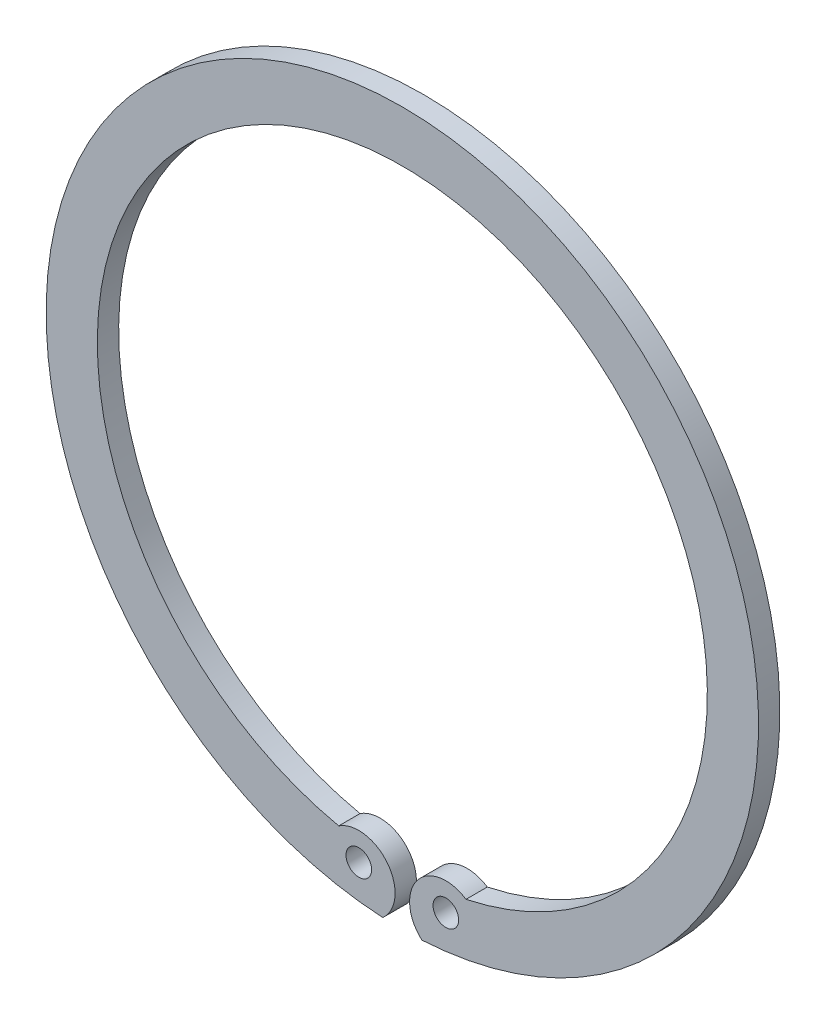
ISO-10303-21;
HEADER;
FILE_DESCRIPTION(('STEP AP214'),'2;1');
FILE_NAME('part.step','',(''),(''),'','','');
FILE_SCHEMA(('AUTOMOTIVE_DESIGN { 1 0 10303 214 1 1 1 1 }'));
ENDSEC;
DATA;
#1=APPLICATION_CONTEXT('core data for automotive mechanical design processes');
#2=APPLICATION_PROTOCOL_DEFINITION('international standard','automotive_design',2000,#1);
#3=PRODUCT_CONTEXT('',#1,'mechanical');
#4=PRODUCT('Part','Part','',(#3));
#5=PRODUCT_RELATED_PRODUCT_CATEGORY('part','',(#4));
#6=PRODUCT_DEFINITION_FORMATION('','',#4);
#7=PRODUCT_DEFINITION_CONTEXT('part definition',#1,'design');
#8=PRODUCT_DEFINITION('design','',#6,#7);
#9=PRODUCT_DEFINITION_SHAPE('','',#8);
#10=(LENGTH_UNIT() NAMED_UNIT(*) SI_UNIT(.MILLI.,.METRE.));
#11=(NAMED_UNIT(*) PLANE_ANGLE_UNIT() SI_UNIT($,.RADIAN.));
#12=(NAMED_UNIT(*) SI_UNIT($,.STERADIAN.) SOLID_ANGLE_UNIT());
#13=UNCERTAINTY_MEASURE_WITH_UNIT(LENGTH_MEASURE(1.E-05),#10,'distance_accuracy_value','');
#14=(GEOMETRIC_REPRESENTATION_CONTEXT(3) GLOBAL_UNCERTAINTY_ASSIGNED_CONTEXT((#13)) GLOBAL_UNIT_ASSIGNED_CONTEXT((#10,
#11,#12)) REPRESENTATION_CONTEXT('',''));
#15=CARTESIAN_POINT('',(0.,0.,0.));
#16=DIRECTION('',(0.,0.,1.));
#17=DIRECTION('',(1.,0.,0.));
#18=AXIS2_PLACEMENT_3D('',#15,#16,#17);
#19=CARTESIAN_POINT('',(5.1,-37.5,1.25));
#20=DIRECTION('',(0.,0.,-1.));
#21=DIRECTION('',(1.,0.,0.));
#22=AXIS2_PLACEMENT_3D('',#19,#20,#21);
#23=CYLINDRICAL_SURFACE('',#22,1.5);
#24=CARTESIAN_POINT('',(5.1,-37.5,0.));
#25=DIRECTION('',(0.,0.,1.));
#26=DIRECTION('',(1.,0.,0.));
#27=AXIS2_PLACEMENT_3D('',#24,#25,#26);
#28=CIRCLE('',#27,1.5);
#29=CARTESIAN_POINT('',(3.6,-37.5,0.));
#30=VERTEX_POINT('',#29);
#31=EDGE_CURVE('E33',#30,#30,#28,.T.);
#32=ORIENTED_EDGE('',*,*,#31,.F.);
#33=EDGE_LOOP('',(#32));
#34=FACE_BOUND('',#33,.T.);
#35=CARTESIAN_POINT('',(5.1,-37.5,2.5));
#36=DIRECTION('',(0.,0.,-1.));
#37=DIRECTION('',(1.,0.,0.));
#38=AXIS2_PLACEMENT_3D('',#35,#36,#37);
#39=CIRCLE('',#38,1.5);
#40=CARTESIAN_POINT('',(3.6,-37.5,2.5));
#41=VERTEX_POINT('',#40);
#42=EDGE_CURVE('E26',#41,#41,#39,.T.);
#43=ORIENTED_EDGE('',*,*,#42,.F.);
#44=EDGE_LOOP('',(#43));
#45=FACE_BOUND('',#44,.T.);
#46=ADVANCED_FACE('F16',(#34,#45),#23,.F.);
#47=CARTESIAN_POINT('',(-5.1,-37.5,1.25));
#48=DIRECTION('',(0.,0.,-1.));
#49=DIRECTION('',(1.,0.,0.));
#50=AXIS2_PLACEMENT_3D('',#47,#48,#49);
#51=CYLINDRICAL_SURFACE('',#50,1.5);
#52=CARTESIAN_POINT('',(-5.1,-37.5,0.));
#53=DIRECTION('',(0.,0.,1.));
#54=DIRECTION('',(1.,0.,0.));
#55=AXIS2_PLACEMENT_3D('',#52,#53,#54);
#56=CIRCLE('',#55,1.5);
#57=CARTESIAN_POINT('',(-6.6,-37.5,0.));
#58=VERTEX_POINT('',#57);
#59=EDGE_CURVE('E54',#58,#58,#56,.T.);
#60=ORIENTED_EDGE('',*,*,#59,.F.);
#61=EDGE_LOOP('',(#60));
#62=FACE_BOUND('',#61,.T.);
#63=CARTESIAN_POINT('',(-5.1,-37.5,2.5));
#64=DIRECTION('',(0.,0.,-1.));
#65=DIRECTION('',(1.,0.,0.));
#66=AXIS2_PLACEMENT_3D('',#63,#64,#65);
#67=CIRCLE('',#66,1.5);
#68=CARTESIAN_POINT('',(-6.6,-37.5,2.5));
#69=VERTEX_POINT('',#68);
#70=EDGE_CURVE('E79',#69,#69,#67,.T.);
#71=ORIENTED_EDGE('',*,*,#70,.F.);
#72=EDGE_LOOP('',(#71));
#73=FACE_BOUND('',#72,.T.);
#74=ADVANCED_FACE('F18',(#62,#73),#51,.F.);
#75=CARTESIAN_POINT('',(5.1,-38.5,1.25));
#76=DIRECTION('',(0.,0.,1.));
#77=DIRECTION('',(-1.,0.,0.));
#78=AXIS2_PLACEMENT_3D('',#75,#76,#77);
#79=CYLINDRICAL_SURFACE('',#78,4.25);
#80=DIRECTION('',(0.,0.,1.));
#81=VECTOR('',#80,1.);
#82=CARTESIAN_POINT('',(7.45718662486297,-34.9635934600831,1.25));
#83=LINE('',#82,#81);
#84=CARTESIAN_POINT('',(7.45718662486301,-34.9635934600831,0.));
#85=VERTEX_POINT('',#84);
#86=CARTESIAN_POINT('',(7.45718662486297,-34.9635934600831,2.5));
#87=VERTEX_POINT('',#86);
#88=EDGE_CURVE('E66',#85,#87,#83,.T.);
#89=ORIENTED_EDGE('',*,*,#88,.F.);
#90=CARTESIAN_POINT('',(5.1,-38.5,0.));
#91=DIRECTION('',(0.,0.,-1.));
#92=DIRECTION('',(-1.,0.,0.));
#93=AXIS2_PLACEMENT_3D('',#90,#91,#92);
#94=CIRCLE('',#93,4.25);
#95=CARTESIAN_POINT('',(2.28857981133469,-41.6872270899271,0.));
#96=VERTEX_POINT('',#95);
#97=EDGE_CURVE('E62',#96,#85,#94,.T.);
#98=ORIENTED_EDGE('',*,*,#97,.F.);
#99=DIRECTION('',(0.,0.,1.));
#100=VECTOR('',#99,1.);
#101=CARTESIAN_POINT('',(2.28857981133469,-41.6872270899271,1.25));
#102=LINE('',#101,#100);
#103=CARTESIAN_POINT('',(2.28857981133469,-41.6872270899271,2.5));
#104=VERTEX_POINT('',#103);
#105=EDGE_CURVE('E11',#96,#104,#102,.T.);
#106=ORIENTED_EDGE('',*,*,#105,.T.);
#107=CARTESIAN_POINT('',(5.1,-38.5,2.5));
#108=DIRECTION('',(0.,0.,1.));
#109=DIRECTION('',(-1.,0.,0.));
#110=AXIS2_PLACEMENT_3D('',#107,#108,#109);
#111=CIRCLE('',#110,4.25);
#112=EDGE_CURVE('E67',#87,#104,#111,.T.);
#113=ORIENTED_EDGE('',*,*,#112,.F.);
#114=EDGE_LOOP('',(#89,#98,#106,#113));
#115=FACE_BOUND('',#114,.T.);
#116=ADVANCED_FACE('F117',(#115),#79,.T.);
#117=CARTESIAN_POINT('',(0.,0.,2.5));
#118=DIRECTION('',(0.,0.,1.));
#119=DIRECTION('',(1.,0.,0.));
#120=AXIS2_PLACEMENT_3D('',#117,#118,#119);
#121=PLANE('',#120);
#122=ORIENTED_EDGE('',*,*,#42,.T.);
#123=EDGE_LOOP('',(#122));
#124=FACE_BOUND('',#123,.T.);
#125=ORIENTED_EDGE('',*,*,#70,.T.);
#126=EDGE_LOOP('',(#125));
#127=FACE_BOUND('',#126,.T.);
#128=CARTESIAN_POINT('',(0.,0.,2.5));
#129=DIRECTION('',(0.,0.,-1.));
#130=DIRECTION('',(1.,0.,0.));
#131=AXIS2_PLACEMENT_3D('',#128,#129,#130);
#132=CIRCLE('',#131,35.75);
#133=CARTESIAN_POINT('',(-7.45718662486297,-34.9635934600831,2.5));
#134=VERTEX_POINT('',#133);
#135=EDGE_CURVE('E69',#134,#87,#132,.T.);
#136=ORIENTED_EDGE('',*,*,#135,.T.);
#137=ORIENTED_EDGE('',*,*,#112,.T.);
#138=CARTESIAN_POINT('',(0.,0.,2.5));
#139=DIRECTION('',(0.,0.,1.));
#140=DIRECTION('',(1.,0.,0.));
#141=AXIS2_PLACEMENT_3D('',#138,#139,#140);
#142=CIRCLE('',#141,41.75);
#143=CARTESIAN_POINT('',(-2.28857981133469,-41.6872270899271,2.5));
#144=VERTEX_POINT('',#143);
#145=EDGE_CURVE('E20',#104,#144,#142,.T.);
#146=ORIENTED_EDGE('',*,*,#145,.T.);
#147=CARTESIAN_POINT('',(-5.1,-38.5,2.5));
#148=DIRECTION('',(0.,0.,1.));
#149=DIRECTION('',(1.,0.,0.));
#150=AXIS2_PLACEMENT_3D('',#147,#148,#149);
#151=CIRCLE('',#150,4.25);
#152=EDGE_CURVE('E75',#144,#134,#151,.T.);
#153=ORIENTED_EDGE('',*,*,#152,.T.);
#154=EDGE_LOOP('',(#136,#137,#146,#153));
#155=FACE_BOUND('',#154,.T.);
#156=ADVANCED_FACE('F116',(#124,#127,#155),#121,.T.);
#157=CARTESIAN_POINT('',(0.,0.,1.25));
#158=DIRECTION('',(0.,0.,-1.));
#159=DIRECTION('',(1.,0.,0.));
#160=AXIS2_PLACEMENT_3D('',#157,#158,#159);
#161=CYLINDRICAL_SURFACE('',#160,41.75);
#162=ORIENTED_EDGE('',*,*,#145,.F.);
#163=ORIENTED_EDGE('',*,*,#105,.F.);
#164=CARTESIAN_POINT('',(0.,0.,0.));
#165=DIRECTION('',(0.,0.,-1.));
#166=DIRECTION('',(-1.,0.,0.));
#167=AXIS2_PLACEMENT_3D('',#164,#165,#166);
#168=CIRCLE('',#167,41.75);
#169=CARTESIAN_POINT('',(-2.28857981133469,-41.6872270899271,0.));
#170=VERTEX_POINT('',#169);
#171=EDGE_CURVE('E57',#170,#96,#168,.T.);
#172=ORIENTED_EDGE('',*,*,#171,.F.);
#173=DIRECTION('',(0.,0.,-1.));
#174=VECTOR('',#173,1.);
#175=CARTESIAN_POINT('',(-2.28857981133469,-41.6872270899271,1.25));
#176=LINE('',#175,#174);
#177=EDGE_CURVE('E59',#144,#170,#176,.T.);
#178=ORIENTED_EDGE('',*,*,#177,.F.);
#179=EDGE_LOOP('',(#162,#163,#172,#178));
#180=FACE_BOUND('',#179,.T.);
#181=ADVANCED_FACE('F118',(#180),#161,.T.);
#182=CARTESIAN_POINT('',(-5.1,-38.5,1.25));
#183=DIRECTION('',(0.,0.,-1.));
#184=DIRECTION('',(1.,0.,0.));
#185=AXIS2_PLACEMENT_3D('',#182,#183,#184);
#186=CYLINDRICAL_SURFACE('',#185,4.25);
#187=DIRECTION('',(0.,0.,-1.));
#188=VECTOR('',#187,1.);
#189=CARTESIAN_POINT('',(-7.45718662486297,-34.9635934600831,1.25));
#190=LINE('',#189,#188);
#191=CARTESIAN_POINT('',(-7.45718662486297,-34.9635934600831,0.));
#192=VERTEX_POINT('',#191);
#193=EDGE_CURVE('E107',#134,#192,#190,.T.);
#194=ORIENTED_EDGE('',*,*,#193,.F.);
#195=ORIENTED_EDGE('',*,*,#152,.F.);
#196=ORIENTED_EDGE('',*,*,#177,.T.);
#197=CARTESIAN_POINT('',(-5.1,-38.5,0.));
#198=DIRECTION('',(0.,0.,-1.));
#199=DIRECTION('',(1.,0.,0.));
#200=AXIS2_PLACEMENT_3D('',#197,#198,#199);
#201=CIRCLE('',#200,4.25);
#202=EDGE_CURVE('E71',#192,#170,#201,.T.);
#203=ORIENTED_EDGE('',*,*,#202,.F.);
#204=EDGE_LOOP('',(#194,#195,#196,#203));
#205=FACE_BOUND('',#204,.T.);
#206=ADVANCED_FACE('F91',(#205),#186,.T.);
#207=CARTESIAN_POINT('',(0.,0.,0.));
#208=DIRECTION('',(0.,0.,-1.));
#209=DIRECTION('',(-1.,0.,0.));
#210=AXIS2_PLACEMENT_3D('',#207,#208,#209);
#211=PLANE('',#210);
#212=ORIENTED_EDGE('',*,*,#31,.T.);
#213=EDGE_LOOP('',(#212));
#214=FACE_BOUND('',#213,.T.);
#215=ORIENTED_EDGE('',*,*,#59,.T.);
#216=EDGE_LOOP('',(#215));
#217=FACE_BOUND('',#216,.T.);
#218=ORIENTED_EDGE('',*,*,#171,.T.);
#219=ORIENTED_EDGE('',*,*,#97,.T.);
#220=CARTESIAN_POINT('',(0.,0.,0.));
#221=DIRECTION('',(0.,0.,1.));
#222=DIRECTION('',(1.,0.,0.));
#223=AXIS2_PLACEMENT_3D('',#220,#221,#222);
#224=CIRCLE('',#223,35.75);
#225=EDGE_CURVE('E73',#85,#192,#224,.T.);
#226=ORIENTED_EDGE('',*,*,#225,.T.);
#227=ORIENTED_EDGE('',*,*,#202,.T.);
#228=EDGE_LOOP('',(#218,#219,#226,#227));
#229=FACE_BOUND('',#228,.T.);
#230=ADVANCED_FACE('F97',(#214,#217,#229),#211,.T.);
#231=CARTESIAN_POINT('',(0.,0.,-2.5));
#232=DIRECTION('',(0.,0.,-1.));
#233=DIRECTION('',(1.,0.,0.));
#234=AXIS2_PLACEMENT_3D('',#231,#232,#233);
#235=CYLINDRICAL_SURFACE('',#234,35.75);
#236=ORIENTED_EDGE('',*,*,#88,.T.);
#237=ORIENTED_EDGE('',*,*,#135,.F.);
#238=ORIENTED_EDGE('',*,*,#193,.T.);
#239=ORIENTED_EDGE('',*,*,#225,.F.);
#240=EDGE_LOOP('',(#236,#237,#238,#239));
#241=FACE_BOUND('',#240,.T.);
#242=ADVANCED_FACE('F103',(#241),#235,.F.);
#243=CLOSED_SHELL('',(#46,#74,#116,#156,#181,#206,#230,#242));
#244=MANIFOLD_SOLID_BREP('B1',#243);
#245=ADVANCED_BREP_SHAPE_REPRESENTATION('',(#18,#244),#14);
#246=SHAPE_DEFINITION_REPRESENTATION(#9,#245);
ENDSEC;
END-ISO-10303-21;
